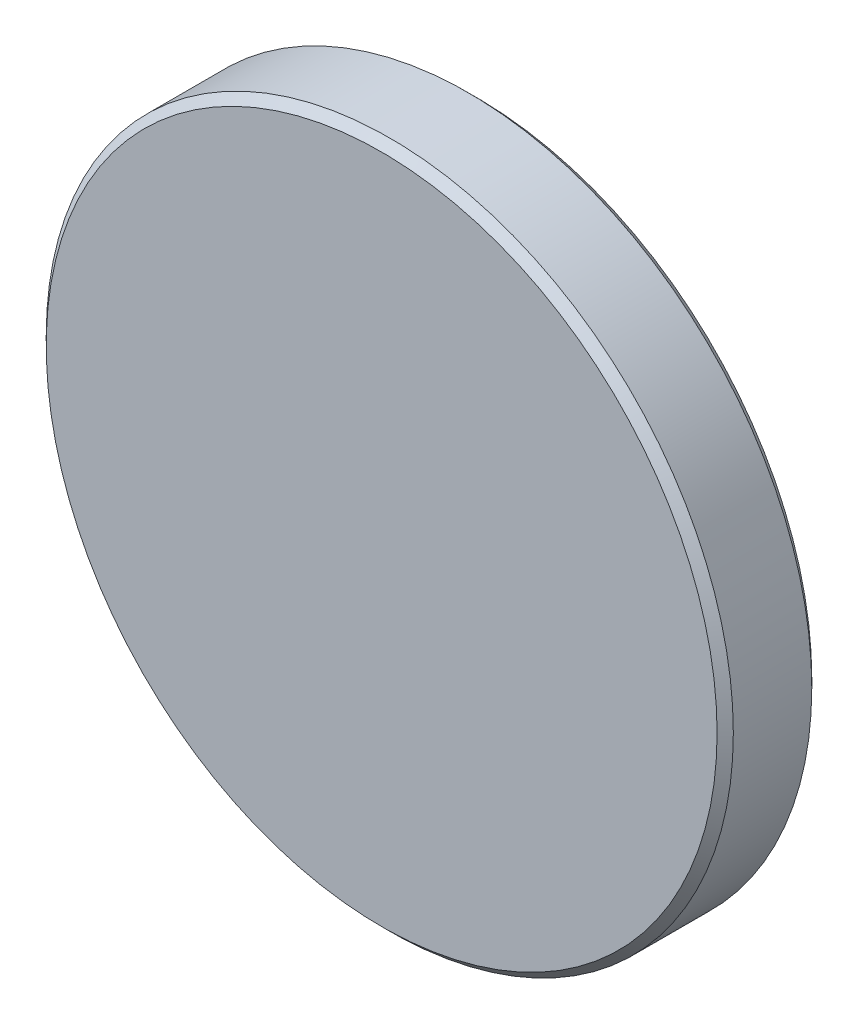
ISO-10303-21;
HEADER;
FILE_DESCRIPTION(('STEP AP214'),'2;1');
FILE_NAME('part.step','',(''),(''),'','','');
FILE_SCHEMA(('AUTOMOTIVE_DESIGN { 1 0 10303 214 1 1 1 1 }'));
ENDSEC;
DATA;
#1=APPLICATION_CONTEXT('core data for automotive mechanical design processes');
#2=APPLICATION_PROTOCOL_DEFINITION('international standard','automotive_design',2000,#1);
#3=PRODUCT_CONTEXT('',#1,'mechanical');
#4=PRODUCT('Part','Part','',(#3));
#5=PRODUCT_RELATED_PRODUCT_CATEGORY('part','',(#4));
#6=PRODUCT_DEFINITION_FORMATION('','',#4);
#7=PRODUCT_DEFINITION_CONTEXT('part definition',#1,'design');
#8=PRODUCT_DEFINITION('design','',#6,#7);
#9=PRODUCT_DEFINITION_SHAPE('','',#8);
#10=(LENGTH_UNIT() NAMED_UNIT(*) SI_UNIT(.MILLI.,.METRE.));
#11=(NAMED_UNIT(*) PLANE_ANGLE_UNIT() SI_UNIT($,.RADIAN.));
#12=(NAMED_UNIT(*) SI_UNIT($,.STERADIAN.) SOLID_ANGLE_UNIT());
#13=UNCERTAINTY_MEASURE_WITH_UNIT(LENGTH_MEASURE(1.E-05),#10,'distance_accuracy_value','');
#14=(GEOMETRIC_REPRESENTATION_CONTEXT(3) GLOBAL_UNCERTAINTY_ASSIGNED_CONTEXT((#13)) GLOBAL_UNIT_ASSIGNED_CONTEXT((#10,
#11,#12)) REPRESENTATION_CONTEXT('',''));
#15=CARTESIAN_POINT('',(0.,0.,0.));
#16=DIRECTION('',(0.,0.,1.));
#17=DIRECTION('',(1.,0.,0.));
#18=AXIS2_PLACEMENT_3D('',#15,#16,#17);
#19=CARTESIAN_POINT('',(0.,0.,3.5));
#20=DIRECTION('',(0.,0.,-1.));
#21=DIRECTION('',(-1.,0.,0.));
#22=AXIS2_PLACEMENT_3D('',#19,#20,#21);
#23=CYLINDRICAL_SURFACE('',#22,12.7);
#24=CARTESIAN_POINT('',(0.,0.,0.299999999999998));
#25=DIRECTION('',(0.,0.,1.));
#26=DIRECTION('',(1.,0.,0.));
#27=AXIS2_PLACEMENT_3D('',#24,#25,#26);
#28=CIRCLE('',#27,12.7);
#29=CARTESIAN_POINT('',(12.7,0.,0.299999999999998));
#30=VERTEX_POINT('',#29);
#31=EDGE_CURVE('E44',#30,#30,#28,.T.);
#32=ORIENTED_EDGE('',*,*,#31,.T.);
#33=EDGE_LOOP('',(#32));
#34=FACE_BOUND('',#33,.T.);
#35=CARTESIAN_POINT('',(0.,0.,3.20000000000001));
#36=DIRECTION('',(0.,0.,1.));
#37=DIRECTION('',(1.,0.,0.));
#38=AXIS2_PLACEMENT_3D('',#35,#36,#37);
#39=CIRCLE('',#38,12.7);
#40=CARTESIAN_POINT('',(12.7,0.,3.20000000000001));
#41=VERTEX_POINT('',#40);
#42=EDGE_CURVE('E48',#41,#41,#39,.F.);
#43=ORIENTED_EDGE('',*,*,#42,.T.);
#44=EDGE_LOOP('',(#43));
#45=FACE_BOUND('',#44,.T.);
#46=ADVANCED_FACE('F33',(#34,#45),#23,.T.);
#47=CARTESIAN_POINT('',(0.,0.,3.5));
#48=DIRECTION('',(0.,0.,1.));
#49=DIRECTION('',(1.,0.,0.));
#50=AXIS2_PLACEMENT_3D('',#47,#48,#49);
#51=PLANE('',#50);
#52=CARTESIAN_POINT('',(0.,0.,3.5));
#53=DIRECTION('',(0.,0.,1.));
#54=DIRECTION('',(1.,0.,0.));
#55=AXIS2_PLACEMENT_3D('',#52,#53,#54);
#56=CIRCLE('',#55,12.4);
#57=CARTESIAN_POINT('',(12.4,0.,3.5));
#58=VERTEX_POINT('',#57);
#59=EDGE_CURVE('E10',#58,#58,#56,.T.);
#60=ORIENTED_EDGE('',*,*,#59,.T.);
#61=EDGE_LOOP('',(#60));
#62=FACE_BOUND('',#61,.T.);
#63=ADVANCED_FACE('F64',(#62),#51,.T.);
#64=CARTESIAN_POINT('',(0.,0.,0.));
#65=DIRECTION('',(0.,0.,1.));
#66=DIRECTION('',(1.,0.,0.));
#67=AXIS2_PLACEMENT_3D('',#64,#65,#66);
#68=PLANE('',#67);
#69=CARTESIAN_POINT('',(0.,0.,0.));
#70=DIRECTION('',(0.,0.,1.));
#71=DIRECTION('',(1.,0.,0.));
#72=AXIS2_PLACEMENT_3D('',#69,#70,#71);
#73=CIRCLE('',#72,12.4);
#74=CARTESIAN_POINT('',(12.4,0.,0.));
#75=VERTEX_POINT('',#74);
#76=EDGE_CURVE('E40',#75,#75,#73,.F.);
#77=ORIENTED_EDGE('',*,*,#76,.T.);
#78=EDGE_LOOP('',(#77));
#79=FACE_BOUND('',#78,.T.);
#80=ADVANCED_FACE('F61',(#79),#68,.F.);
#81=CARTESIAN_POINT('',(0.,0.,0.299999999999998));
#82=DIRECTION('',(0.,0.,1.));
#83=DIRECTION('',(1.,0.,0.));
#84=AXIS2_PLACEMENT_3D('',#81,#82,#83);
#85=CONICAL_SURFACE('',#84,12.7,0.785398163397454);
#86=ORIENTED_EDGE('',*,*,#76,.F.);
#87=EDGE_LOOP('',(#86));
#88=FACE_BOUND('',#87,.T.);
#89=ORIENTED_EDGE('',*,*,#31,.F.);
#90=EDGE_LOOP('',(#89));
#91=FACE_BOUND('',#90,.T.);
#92=ADVANCED_FACE('F57',(#88,#91),#85,.T.);
#93=CARTESIAN_POINT('',(0.,0.,3.5));
#94=DIRECTION('',(0.,0.,-1.));
#95=DIRECTION('',(-1.,0.,0.));
#96=AXIS2_PLACEMENT_3D('',#93,#94,#95);
#97=CONICAL_SURFACE('',#96,12.4,0.785398163397451);
#98=ORIENTED_EDGE('',*,*,#42,.F.);
#99=EDGE_LOOP('',(#98));
#100=FACE_BOUND('',#99,.T.);
#101=ORIENTED_EDGE('',*,*,#59,.F.);
#102=EDGE_LOOP('',(#101));
#103=FACE_BOUND('',#102,.T.);
#104=ADVANCED_FACE('F35',(#100,#103),#97,.T.);
#105=CLOSED_SHELL('',(#46,#63,#80,#92,#104));
#106=MANIFOLD_SOLID_BREP('B2',#105);
#107=ADVANCED_BREP_SHAPE_REPRESENTATION('',(#18,#106),#14);
#108=SHAPE_DEFINITION_REPRESENTATION(#9,#107);
ENDSEC;
END-ISO-10303-21;
